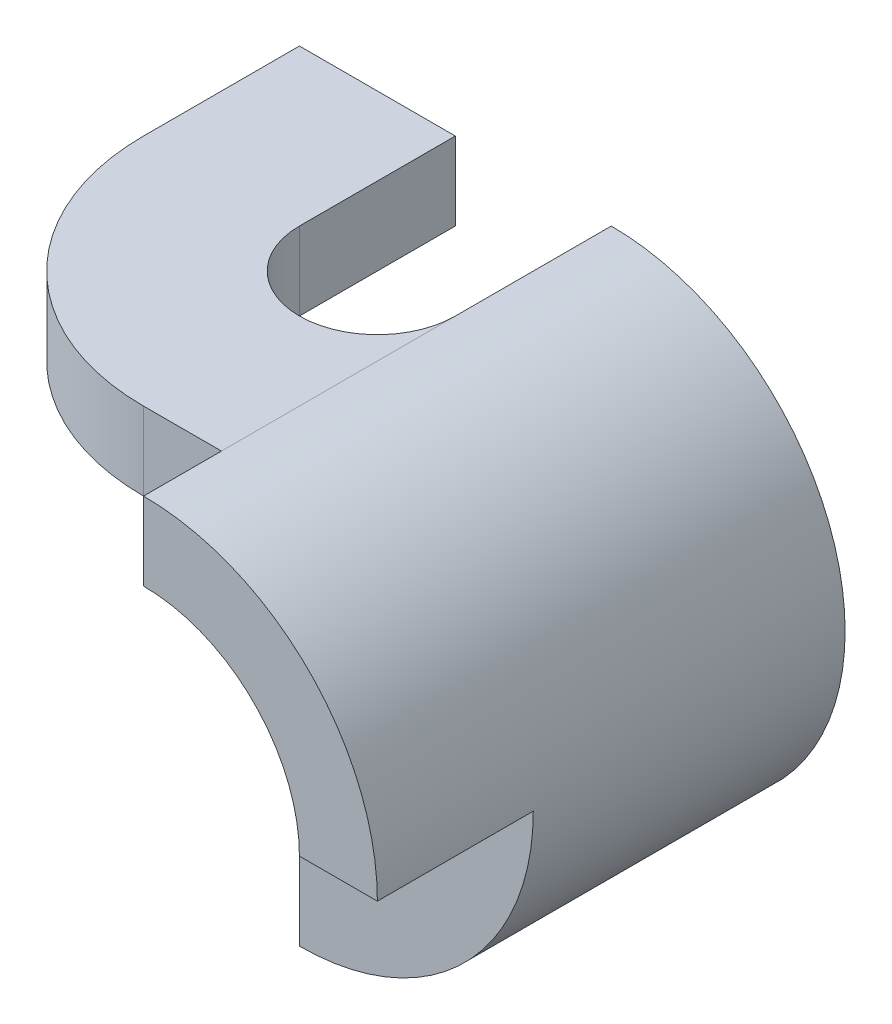
ISO-10303-21;
HEADER;
FILE_DESCRIPTION(('STEP AP214'),'2;1');
FILE_NAME('part.step','',(''),(''),'','','');
FILE_SCHEMA(('AUTOMOTIVE_DESIGN { 1 0 10303 214 1 1 1 1 }'));
ENDSEC;
DATA;
#1=APPLICATION_CONTEXT('core data for automotive mechanical design processes');
#2=APPLICATION_PROTOCOL_DEFINITION('international standard','automotive_design',2000,#1);
#3=PRODUCT_CONTEXT('',#1,'mechanical');
#4=PRODUCT('Part','Part','',(#3));
#5=PRODUCT_RELATED_PRODUCT_CATEGORY('part','',(#4));
#6=PRODUCT_DEFINITION_FORMATION('','',#4);
#7=PRODUCT_DEFINITION_CONTEXT('part definition',#1,'design');
#8=PRODUCT_DEFINITION('design','',#6,#7);
#9=PRODUCT_DEFINITION_SHAPE('','',#8);
#10=(LENGTH_UNIT() NAMED_UNIT(*) SI_UNIT(.MILLI.,.METRE.));
#11=(NAMED_UNIT(*) PLANE_ANGLE_UNIT() SI_UNIT($,.RADIAN.));
#12=(NAMED_UNIT(*) SI_UNIT($,.STERADIAN.) SOLID_ANGLE_UNIT());
#13=UNCERTAINTY_MEASURE_WITH_UNIT(LENGTH_MEASURE(1.E-05),#10,'distance_accuracy_value','');
#14=(GEOMETRIC_REPRESENTATION_CONTEXT(3) GLOBAL_UNCERTAINTY_ASSIGNED_CONTEXT((#13)) GLOBAL_UNIT_ASSIGNED_CONTEXT((#10,
#11,#12)) REPRESENTATION_CONTEXT('',''));
#15=CARTESIAN_POINT('',(0.,0.,0.));
#16=DIRECTION('',(0.,0.,1.));
#17=DIRECTION('',(1.,0.,0.));
#18=AXIS2_PLACEMENT_3D('',#15,#16,#17);
#19=CARTESIAN_POINT('',(0.,0.,0.));
#20=DIRECTION('',(0.,0.,-1.));
#21=DIRECTION('',(-1.,0.,0.));
#22=AXIS2_PLACEMENT_3D('',#19,#20,#21);
#23=PLANE('',#22);
#24=DIRECTION('',(0.,-1.,0.));
#25=VECTOR('',#24,1.);
#26=CARTESIAN_POINT('',(0.,0.,0.));
#27=LINE('',#26,#25);
#28=CARTESIAN_POINT('',(0.,3.,0.));
#29=VERTEX_POINT('',#28);
#30=CARTESIAN_POINT('',(0.,2.,0.));
#31=VERTEX_POINT('',#30);
#32=EDGE_CURVE('E11',#29,#31,#27,.T.);
#33=ORIENTED_EDGE('',*,*,#32,.F.);
#34=CARTESIAN_POINT('',(0.,0.,0.));
#35=DIRECTION('',(0.,0.,1.));
#36=DIRECTION('',(-1.,0.,0.));
#37=AXIS2_PLACEMENT_3D('',#34,#35,#36);
#38=CIRCLE('',#37,3.);
#39=CARTESIAN_POINT('',(0.,-3.,0.));
#40=VERTEX_POINT('',#39);
#41=EDGE_CURVE('E160',#40,#29,#38,.T.);
#42=ORIENTED_EDGE('',*,*,#41,.F.);
#43=DIRECTION('',(1.,0.,0.));
#44=VECTOR('',#43,1.);
#45=CARTESIAN_POINT('',(-0.999999999999999,-3.,0.));
#46=LINE('',#45,#44);
#47=CARTESIAN_POINT('',(-0.999999999999999,-3.,0.));
#48=VERTEX_POINT('',#47);
#49=EDGE_CURVE('E165',#48,#40,#46,.T.);
#50=ORIENTED_EDGE('',*,*,#49,.F.);
#51=DIRECTION('',(0.,-1.,0.));
#52=VECTOR('',#51,1.);
#53=CARTESIAN_POINT('',(-1.,-2.,0.));
#54=LINE('',#53,#52);
#55=CARTESIAN_POINT('',(-1.,-2.,0.));
#56=VERTEX_POINT('',#55);
#57=EDGE_CURVE('E216',#56,#48,#54,.T.);
#58=ORIENTED_EDGE('',*,*,#57,.F.);
#59=DIRECTION('',(-1.,0.,0.));
#60=VECTOR('',#59,1.);
#61=CARTESIAN_POINT('',(0.,-2.,0.));
#62=LINE('',#61,#60);
#63=CARTESIAN_POINT('',(0.,-2.,0.));
#64=VERTEX_POINT('',#63);
#65=EDGE_CURVE('E213',#64,#56,#62,.T.);
#66=ORIENTED_EDGE('',*,*,#65,.F.);
#67=CARTESIAN_POINT('',(0.,0.,0.));
#68=DIRECTION('',(0.,0.,-1.));
#69=DIRECTION('',(-1.,0.,0.));
#70=AXIS2_PLACEMENT_3D('',#67,#68,#69);
#71=CIRCLE('',#70,2.);
#72=EDGE_CURVE('E210',#31,#64,#71,.T.);
#73=ORIENTED_EDGE('',*,*,#72,.F.);
#74=EDGE_LOOP('',(#33,#42,#50,#58,#66,#73));
#75=FACE_BOUND('',#74,.T.);
#76=ADVANCED_FACE('F33',(#75),#23,.T.);
#77=CARTESIAN_POINT('',(-4.,3.,6.));
#78=DIRECTION('',(0.,-1.,0.));
#79=DIRECTION('',(0.,0.,-1.));
#80=AXIS2_PLACEMENT_3D('',#77,#78,#79);
#81=PLANE('',#80);
#82=DIRECTION('',(0.,0.,-1.));
#83=VECTOR('',#82,1.);
#84=CARTESIAN_POINT('',(0.,3.,6.));
#85=LINE('',#84,#83);
#86=CARTESIAN_POINT('',(0.,3.,5.));
#87=VERTEX_POINT('',#86);
#88=CARTESIAN_POINT('',(0.,3.,2.));
#89=VERTEX_POINT('',#88);
#90=EDGE_CURVE('E179',#87,#89,#85,.T.);
#91=ORIENTED_EDGE('',*,*,#90,.T.);
#92=CARTESIAN_POINT('',(-1.,3.,2.));
#93=DIRECTION('',(0.,1.,0.));
#94=DIRECTION('',(0.,0.,1.));
#95=AXIS2_PLACEMENT_3D('',#92,#93,#94);
#96=CIRCLE('',#95,1.);
#97=CARTESIAN_POINT('',(-2.,3.,2.));
#98=VERTEX_POINT('',#97);
#99=EDGE_CURVE('E154',#98,#89,#96,.T.);
#100=ORIENTED_EDGE('',*,*,#99,.F.);
#101=DIRECTION('',(0.,0.,1.));
#102=VECTOR('',#101,1.);
#103=CARTESIAN_POINT('',(-2.,3.,0.));
#104=LINE('',#103,#102);
#105=CARTESIAN_POINT('',(-2.,3.,0.));
#106=VERTEX_POINT('',#105);
#107=EDGE_CURVE('E140',#106,#98,#104,.T.);
#108=ORIENTED_EDGE('',*,*,#107,.F.);
#109=DIRECTION('',(-1.,0.,0.));
#110=VECTOR('',#109,1.);
#111=CARTESIAN_POINT('',(-4.,3.,0.));
#112=LINE('',#111,#110);
#113=CARTESIAN_POINT('',(-4.,3.,0.));
#114=VERTEX_POINT('',#113);
#115=EDGE_CURVE('E151',#106,#114,#112,.T.);
#116=ORIENTED_EDGE('',*,*,#115,.T.);
#117=DIRECTION('',(0.,0.,-1.));
#118=VECTOR('',#117,1.);
#119=CARTESIAN_POINT('',(-4.,3.,6.));
#120=LINE('',#119,#118);
#121=CARTESIAN_POINT('',(-4.,3.,2.));
#122=VERTEX_POINT('',#121);
#123=EDGE_CURVE('E177',#122,#114,#120,.T.);
#124=ORIENTED_EDGE('',*,*,#123,.F.);
#125=CARTESIAN_POINT('',(-0.999999999999995,3.,2.));
#126=DIRECTION('',(0.,-1.,0.));
#127=DIRECTION('',(0.,0.,-1.));
#128=AXIS2_PLACEMENT_3D('',#125,#126,#127);
#129=CIRCLE('',#128,3.00000000000001);
#130=CARTESIAN_POINT('',(-1.,3.,5.));
#131=VERTEX_POINT('',#130);
#132=EDGE_CURVE('E266',#131,#122,#129,.T.);
#133=ORIENTED_EDGE('',*,*,#132,.F.);
#134=DIRECTION('',(-1.,0.,0.));
#135=VECTOR('',#134,1.);
#136=CARTESIAN_POINT('',(-4.,3.,5.));
#137=LINE('',#136,#135);
#138=EDGE_CURVE('E270',#87,#131,#137,.T.);
#139=ORIENTED_EDGE('',*,*,#138,.F.);
#140=EDGE_LOOP('',(#91,#100,#108,#116,#124,#133,#139));
#141=FACE_BOUND('',#140,.T.);
#142=ADVANCED_FACE('F149',(#141),#81,.F.);
#143=CARTESIAN_POINT('',(-4.,2.,6.));
#144=DIRECTION('',(1.,0.,0.));
#145=DIRECTION('',(0.,0.,-1.));
#146=AXIS2_PLACEMENT_3D('',#143,#144,#145);
#147=PLANE('',#146);
#148=DIRECTION('',(0.,-1.,0.));
#149=VECTOR('',#148,1.);
#150=CARTESIAN_POINT('',(-4.,4.,2.));
#151=LINE('',#150,#149);
#152=CARTESIAN_POINT('',(-4.,2.,2.));
#153=VERTEX_POINT('',#152);
#154=EDGE_CURVE('E272',#122,#153,#151,.T.);
#155=ORIENTED_EDGE('',*,*,#154,.F.);
#156=ORIENTED_EDGE('',*,*,#123,.T.);
#157=DIRECTION('',(0.,-1.,0.));
#158=VECTOR('',#157,1.);
#159=CARTESIAN_POINT('',(-4.,2.,0.));
#160=LINE('',#159,#158);
#161=CARTESIAN_POINT('',(-4.,2.,0.));
#162=VERTEX_POINT('',#161);
#163=EDGE_CURVE('E159',#114,#162,#160,.T.);
#164=ORIENTED_EDGE('',*,*,#163,.T.);
#165=DIRECTION('',(0.,0.,-1.));
#166=VECTOR('',#165,1.);
#167=CARTESIAN_POINT('',(-4.,2.,6.));
#168=LINE('',#167,#166);
#169=EDGE_CURVE('E174',#153,#162,#168,.T.);
#170=ORIENTED_EDGE('',*,*,#169,.F.);
#171=EDGE_LOOP('',(#155,#156,#164,#170));
#172=FACE_BOUND('',#171,.T.);
#173=ADVANCED_FACE('F306',(#172),#147,.F.);
#174=CARTESIAN_POINT('',(0.,2.,6.));
#175=DIRECTION('',(0.,1.,0.));
#176=DIRECTION('',(-1.,0.,0.));
#177=AXIS2_PLACEMENT_3D('',#174,#175,#176);
#178=PLANE('',#177);
#179=DIRECTION('',(0.,0.,1.));
#180=VECTOR('',#179,1.);
#181=CARTESIAN_POINT('',(-2.,2.,6.));
#182=LINE('',#181,#180);
#183=CARTESIAN_POINT('',(-2.,2.,0.));
#184=VERTEX_POINT('',#183);
#185=CARTESIAN_POINT('',(-2.,2.,2.));
#186=VERTEX_POINT('',#185);
#187=EDGE_CURVE('E48',#184,#186,#182,.T.);
#188=ORIENTED_EDGE('',*,*,#187,.T.);
#189=CARTESIAN_POINT('',(-1.,2.,2.));
#190=DIRECTION('',(0.,1.,0.));
#191=DIRECTION('',(-1.,0.,0.));
#192=AXIS2_PLACEMENT_3D('',#189,#190,#191);
#193=CIRCLE('',#192,1.);
#194=CARTESIAN_POINT('',(0.,2.,2.));
#195=VERTEX_POINT('',#194);
#196=EDGE_CURVE('E284',#186,#195,#193,.T.);
#197=ORIENTED_EDGE('',*,*,#196,.T.);
#198=DIRECTION('',(0.,0.,-1.));
#199=VECTOR('',#198,1.);
#200=CARTESIAN_POINT('',(0.,2.,6.));
#201=LINE('',#200,#199);
#202=CARTESIAN_POINT('',(0.,2.,5.));
#203=VERTEX_POINT('',#202);
#204=EDGE_CURVE('E175',#203,#195,#201,.T.);
#205=ORIENTED_EDGE('',*,*,#204,.F.);
#206=DIRECTION('',(-1.,0.,0.));
#207=VECTOR('',#206,1.);
#208=CARTESIAN_POINT('',(0.,2.,5.));
#209=LINE('',#208,#207);
#210=CARTESIAN_POINT('',(-1.,2.,5.));
#211=VERTEX_POINT('',#210);
#212=EDGE_CURVE('E276',#203,#211,#209,.T.);
#213=ORIENTED_EDGE('',*,*,#212,.T.);
#214=CARTESIAN_POINT('',(-0.999999999999995,2.,2.));
#215=DIRECTION('',(0.,-1.,0.));
#216=DIRECTION('',(1.,0.,0.));
#217=AXIS2_PLACEMENT_3D('',#214,#215,#216);
#218=CIRCLE('',#217,3.00000000000001);
#219=EDGE_CURVE('E281',#211,#153,#218,.T.);
#220=ORIENTED_EDGE('',*,*,#219,.T.);
#221=ORIENTED_EDGE('',*,*,#169,.T.);
#222=DIRECTION('',(1.,0.,0.));
#223=VECTOR('',#222,1.);
#224=CARTESIAN_POINT('',(0.,2.,0.));
#225=LINE('',#224,#223);
#226=EDGE_CURVE('E162',#162,#184,#225,.T.);
#227=ORIENTED_EDGE('',*,*,#226,.T.);
#228=EDGE_LOOP('',(#188,#197,#205,#213,#220,#221,#227));
#229=FACE_BOUND('',#228,.T.);
#230=ADVANCED_FACE('F300',(#229),#178,.F.);
#231=CARTESIAN_POINT('',(0.,0.,6.));
#232=DIRECTION('',(0.,0.,-1.));
#233=DIRECTION('',(-1.,0.,0.));
#234=AXIS2_PLACEMENT_3D('',#231,#232,#233);
#235=CYLINDRICAL_SURFACE('',#234,2.);
#236=CARTESIAN_POINT('',(0.,0.,4.));
#237=DIRECTION('',(0.,0.,-1.));
#238=DIRECTION('',(-1.,0.,0.));
#239=AXIS2_PLACEMENT_3D('',#236,#237,#238);
#240=CIRCLE('',#239,2.);
#241=CARTESIAN_POINT('',(2.,0.,4.));
#242=VERTEX_POINT('',#241);
#243=CARTESIAN_POINT('',(0.,-2.,4.));
#244=VERTEX_POINT('',#243);
#245=EDGE_CURVE('E244',#242,#244,#240,.T.);
#246=ORIENTED_EDGE('',*,*,#245,.F.);
#247=DIRECTION('',(0.,0.,1.));
#248=VECTOR('',#247,1.);
#249=CARTESIAN_POINT('',(2.,0.,4.));
#250=LINE('',#249,#248);
#251=CARTESIAN_POINT('',(2.,0.,6.));
#252=VERTEX_POINT('',#251);
#253=EDGE_CURVE('E204',#242,#252,#250,.T.);
#254=ORIENTED_EDGE('',*,*,#253,.T.);
#255=CARTESIAN_POINT('',(0.,0.,6.));
#256=DIRECTION('',(0.,0.,-1.));
#257=DIRECTION('',(-1.,0.,0.));
#258=AXIS2_PLACEMENT_3D('',#255,#256,#257);
#259=CIRCLE('',#258,2.);
#260=CARTESIAN_POINT('',(0.,2.,6.));
#261=VERTEX_POINT('',#260);
#262=EDGE_CURVE('E170',#261,#252,#259,.T.);
#263=ORIENTED_EDGE('',*,*,#262,.F.);
#264=EDGE_CURVE('E171',#261,#203,#201,.T.);
#265=ORIENTED_EDGE('',*,*,#264,.T.);
#266=ORIENTED_EDGE('',*,*,#204,.T.);
#267=DIRECTION('',(0.,0.,-1.));
#268=VECTOR('',#267,1.);
#269=CARTESIAN_POINT('',(0.,2.,6.));
#270=LINE('',#269,#268);
#271=EDGE_CURVE('E287',#195,#31,#270,.T.);
#272=ORIENTED_EDGE('',*,*,#271,.T.);
#273=ORIENTED_EDGE('',*,*,#72,.T.);
#274=DIRECTION('',(0.,0.,-1.));
#275=VECTOR('',#274,1.);
#276=CARTESIAN_POINT('',(0.,-2.,6.));
#277=LINE('',#276,#275);
#278=EDGE_CURVE('E188',#244,#64,#277,.T.);
#279=ORIENTED_EDGE('',*,*,#278,.F.);
#280=EDGE_LOOP('',(#246,#254,#263,#265,#266,#272,#273,#279));
#281=FACE_BOUND('',#280,.T.);
#282=ADVANCED_FACE('F35',(#281),#235,.F.);
#283=CARTESIAN_POINT('',(0.,-2.,6.));
#284=DIRECTION('',(0.,-1.,0.));
#285=DIRECTION('',(1.,0.,0.));
#286=AXIS2_PLACEMENT_3D('',#283,#284,#285);
#287=PLANE('',#286);
#288=DIRECTION('',(0.,0.,-1.));
#289=VECTOR('',#288,1.);
#290=CARTESIAN_POINT('',(-1.,-2.,6.));
#291=LINE('',#290,#289);
#292=CARTESIAN_POINT('',(-0.999999999999999,-2.,2.));
#293=VERTEX_POINT('',#292);
#294=EDGE_CURVE('E186',#293,#56,#291,.T.);
#295=ORIENTED_EDGE('',*,*,#294,.F.);
#296=DIRECTION('',(0.447213595499958,0.,0.894427190999916));
#297=VECTOR('',#296,1.);
#298=CARTESIAN_POINT('',(0.8,-2.,5.6));
#299=LINE('',#298,#297);
#300=EDGE_CURVE('E246',#293,#244,#299,.T.);
#301=ORIENTED_EDGE('',*,*,#300,.T.);
#302=ORIENTED_EDGE('',*,*,#278,.T.);
#303=ORIENTED_EDGE('',*,*,#65,.T.);
#304=EDGE_LOOP('',(#295,#301,#302,#303));
#305=FACE_BOUND('',#304,.T.);
#306=ADVANCED_FACE('F263',(#305),#287,.F.);
#307=CARTESIAN_POINT('',(-1.,-2.,6.));
#308=DIRECTION('',(1.,0.,0.));
#309=DIRECTION('',(0.,1.,0.));
#310=AXIS2_PLACEMENT_3D('',#307,#308,#309);
#311=PLANE('',#310);
#312=DIRECTION('',(0.,0.,-1.));
#313=VECTOR('',#312,1.);
#314=CARTESIAN_POINT('',(-0.999999999999999,-3.,6.));
#315=LINE('',#314,#313);
#316=CARTESIAN_POINT('',(-0.999999999999999,-3.,2.));
#317=VERTEX_POINT('',#316);
#318=EDGE_CURVE('E184',#317,#48,#315,.T.);
#319=ORIENTED_EDGE('',*,*,#318,.F.);
#320=DIRECTION('',(0.,-1.,0.));
#321=VECTOR('',#320,1.);
#322=CARTESIAN_POINT('',(-0.999999999999999,-1.,2.));
#323=LINE('',#322,#321);
#324=EDGE_CURVE('E265',#293,#317,#323,.T.);
#325=ORIENTED_EDGE('',*,*,#324,.F.);
#326=ORIENTED_EDGE('',*,*,#294,.T.);
#327=ORIENTED_EDGE('',*,*,#57,.T.);
#328=EDGE_LOOP('',(#319,#325,#326,#327));
#329=FACE_BOUND('',#328,.T.);
#330=ADVANCED_FACE('F435',(#329),#311,.F.);
#331=CARTESIAN_POINT('',(-0.999999999999999,-3.,6.));
#332=DIRECTION('',(0.,1.,0.));
#333=DIRECTION('',(0.,0.,1.));
#334=AXIS2_PLACEMENT_3D('',#331,#332,#333);
#335=PLANE('',#334);
#336=DIRECTION('',(0.,0.,-1.));
#337=VECTOR('',#336,1.);
#338=CARTESIAN_POINT('',(0.,-3.,6.));
#339=LINE('',#338,#337);
#340=CARTESIAN_POINT('',(0.,-3.,4.));
#341=VERTEX_POINT('',#340);
#342=EDGE_CURVE('E182',#341,#40,#339,.T.);
#343=ORIENTED_EDGE('',*,*,#342,.F.);
#344=DIRECTION('',(0.447213595499958,0.,0.894427190999916));
#345=VECTOR('',#344,1.);
#346=CARTESIAN_POINT('',(0.,-3.,4.));
#347=LINE('',#346,#345);
#348=EDGE_CURVE('E260',#317,#341,#347,.T.);
#349=ORIENTED_EDGE('',*,*,#348,.F.);
#350=ORIENTED_EDGE('',*,*,#318,.T.);
#351=ORIENTED_EDGE('',*,*,#49,.T.);
#352=EDGE_LOOP('',(#343,#349,#350,#351));
#353=FACE_BOUND('',#352,.T.);
#354=ADVANCED_FACE('F223',(#353),#335,.F.);
#355=CARTESIAN_POINT('',(0.,0.,6.));
#356=DIRECTION('',(0.,0.,-1.));
#357=DIRECTION('',(-1.,0.,0.));
#358=AXIS2_PLACEMENT_3D('',#355,#356,#357);
#359=CYLINDRICAL_SURFACE('',#358,3.);
#360=CARTESIAN_POINT('',(0.,0.,6.));
#361=DIRECTION('',(0.,0.,1.));
#362=DIRECTION('',(-1.,0.,0.));
#363=AXIS2_PLACEMENT_3D('',#360,#361,#362);
#364=CIRCLE('',#363,3.);
#365=CARTESIAN_POINT('',(3.,0.,6.));
#366=VERTEX_POINT('',#365);
#367=CARTESIAN_POINT('',(0.,3.,6.));
#368=VERTEX_POINT('',#367);
#369=EDGE_CURVE('E197',#366,#368,#364,.T.);
#370=ORIENTED_EDGE('',*,*,#369,.F.);
#371=DIRECTION('',(0.,0.,1.));
#372=VECTOR('',#371,1.);
#373=CARTESIAN_POINT('',(3.,0.,4.));
#374=LINE('',#373,#372);
#375=CARTESIAN_POINT('',(3.,0.,4.));
#376=VERTEX_POINT('',#375);
#377=EDGE_CURVE('E56',#376,#366,#374,.T.);
#378=ORIENTED_EDGE('',*,*,#377,.F.);
#379=CARTESIAN_POINT('',(0.,0.,4.));
#380=DIRECTION('',(0.,0.,1.));
#381=DIRECTION('',(-1.,0.,0.));
#382=AXIS2_PLACEMENT_3D('',#379,#380,#381);
#383=CIRCLE('',#382,3.);
#384=EDGE_CURVE('E237',#341,#376,#383,.T.);
#385=ORIENTED_EDGE('',*,*,#384,.F.);
#386=ORIENTED_EDGE('',*,*,#342,.T.);
#387=ORIENTED_EDGE('',*,*,#41,.T.);
#388=DIRECTION('',(0.,0.,-1.));
#389=VECTOR('',#388,1.);
#390=CARTESIAN_POINT('',(0.,3.,0.));
#391=LINE('',#390,#389);
#392=EDGE_CURVE('E234',#89,#29,#391,.T.);
#393=ORIENTED_EDGE('',*,*,#392,.F.);
#394=ORIENTED_EDGE('',*,*,#90,.F.);
#395=EDGE_CURVE('E180',#368,#87,#85,.T.);
#396=ORIENTED_EDGE('',*,*,#395,.F.);
#397=EDGE_LOOP('',(#370,#378,#385,#386,#387,#393,#394,#396));
#398=FACE_BOUND('',#397,.T.);
#399=ADVANCED_FACE('F232',(#398),#359,.T.);
#400=CARTESIAN_POINT('',(0.,0.,6.));
#401=DIRECTION('',(0.,0.,-1.));
#402=DIRECTION('',(-1.,0.,0.));
#403=AXIS2_PLACEMENT_3D('',#400,#401,#402);
#404=PLANE('',#403);
#405=ORIENTED_EDGE('',*,*,#369,.T.);
#406=DIRECTION('',(0.,-1.,0.));
#407=VECTOR('',#406,1.);
#408=CARTESIAN_POINT('',(0.,0.,6.));
#409=LINE('',#408,#407);
#410=EDGE_CURVE('E146',#368,#261,#409,.T.);
#411=ORIENTED_EDGE('',*,*,#410,.T.);
#412=ORIENTED_EDGE('',*,*,#262,.T.);
#413=DIRECTION('',(-1.,0.,0.));
#414=VECTOR('',#413,1.);
#415=CARTESIAN_POINT('',(3.,0.,6.));
#416=LINE('',#415,#414);
#417=EDGE_CURVE('E242',#366,#252,#416,.T.);
#418=ORIENTED_EDGE('',*,*,#417,.F.);
#419=EDGE_LOOP('',(#405,#411,#412,#418));
#420=FACE_BOUND('',#419,.T.);
#421=ADVANCED_FACE('F195',(#420),#404,.F.);
#422=DIRECTION('',(0.,1.,0.));
#423=VECTOR('',#422,1.);
#424=CARTESIAN_POINT('',(-2.,0.,0.));
#425=LINE('',#424,#423);
#426=EDGE_CURVE('E41',#184,#106,#425,.T.);
#427=ORIENTED_EDGE('',*,*,#426,.F.);
#428=ORIENTED_EDGE('',*,*,#226,.F.);
#429=ORIENTED_EDGE('',*,*,#163,.F.);
#430=ORIENTED_EDGE('',*,*,#115,.F.);
#431=EDGE_LOOP('',(#427,#428,#429,#430));
#432=FACE_BOUND('',#431,.T.);
#433=ADVANCED_FACE('F157',(#432),#23,.T.);
#434=CARTESIAN_POINT('',(3.,0.,4.));
#435=DIRECTION('',(0.,1.,0.));
#436=DIRECTION('',(0.,0.,1.));
#437=AXIS2_PLACEMENT_3D('',#434,#435,#436);
#438=PLANE('',#437);
#439=ORIENTED_EDGE('',*,*,#417,.T.);
#440=ORIENTED_EDGE('',*,*,#253,.F.);
#441=DIRECTION('',(-1.,0.,0.));
#442=VECTOR('',#441,1.);
#443=CARTESIAN_POINT('',(3.,0.,4.));
#444=LINE('',#443,#442);
#445=EDGE_CURVE('E241',#376,#242,#444,.T.);
#446=ORIENTED_EDGE('',*,*,#445,.F.);
#447=ORIENTED_EDGE('',*,*,#377,.T.);
#448=EDGE_LOOP('',(#439,#440,#446,#447));
#449=FACE_BOUND('',#448,.T.);
#450=ADVANCED_FACE('F336',(#449),#438,.F.);
#451=CARTESIAN_POINT('',(0.,0.,4.));
#452=DIRECTION('',(0.,0.,-1.));
#453=DIRECTION('',(-1.,0.,0.));
#454=AXIS2_PLACEMENT_3D('',#451,#452,#453);
#455=PLANE('',#454);
#456=ORIENTED_EDGE('',*,*,#384,.T.);
#457=ORIENTED_EDGE('',*,*,#445,.T.);
#458=ORIENTED_EDGE('',*,*,#245,.T.);
#459=DIRECTION('',(0.,-1.,0.));
#460=VECTOR('',#459,1.);
#461=CARTESIAN_POINT('',(0.,-2.,4.));
#462=LINE('',#461,#460);
#463=EDGE_CURVE('E253',#244,#341,#462,.T.);
#464=ORIENTED_EDGE('',*,*,#463,.T.);
#465=EDGE_LOOP('',(#456,#457,#458,#464));
#466=FACE_BOUND('',#465,.T.);
#467=ADVANCED_FACE('F254',(#466),#455,.F.);
#468=CARTESIAN_POINT('',(0.,-1.,4.));
#469=DIRECTION('',(0.894427190999916,0.,-0.447213595499958));
#470=DIRECTION('',(-0.447213595499958,0.,-0.894427190999916));
#471=AXIS2_PLACEMENT_3D('',#468,#469,#470);
#472=PLANE('',#471);
#473=ORIENTED_EDGE('',*,*,#324,.T.);
#474=ORIENTED_EDGE('',*,*,#348,.T.);
#475=ORIENTED_EDGE('',*,*,#463,.F.);
#476=ORIENTED_EDGE('',*,*,#300,.F.);
#477=EDGE_LOOP('',(#473,#474,#475,#476));
#478=FACE_BOUND('',#477,.T.);
#479=ADVANCED_FACE('F258',(#478),#472,.F.);
#480=CARTESIAN_POINT('',(-0.999999999999995,4.,2.));
#481=DIRECTION('',(0.,-1.,0.));
#482=DIRECTION('',(1.,0.,0.));
#483=AXIS2_PLACEMENT_3D('',#480,#481,#482);
#484=CYLINDRICAL_SURFACE('',#483,3.00000000000001);
#485=ORIENTED_EDGE('',*,*,#132,.T.);
#486=ORIENTED_EDGE('',*,*,#154,.T.);
#487=ORIENTED_EDGE('',*,*,#219,.F.);
#488=DIRECTION('',(0.,-1.,0.));
#489=VECTOR('',#488,1.);
#490=CARTESIAN_POINT('',(-1.,4.,5.));
#491=LINE('',#490,#489);
#492=EDGE_CURVE('E273',#131,#211,#491,.T.);
#493=ORIENTED_EDGE('',*,*,#492,.F.);
#494=EDGE_LOOP('',(#485,#486,#487,#493));
#495=FACE_BOUND('',#494,.T.);
#496=ADVANCED_FACE('F311',(#495),#484,.T.);
#497=CARTESIAN_POINT('',(0.,4.,5.));
#498=DIRECTION('',(0.,0.,1.));
#499=DIRECTION('',(1.,0.,0.));
#500=AXIS2_PLACEMENT_3D('',#497,#498,#499);
#501=PLANE('',#500);
#502=ORIENTED_EDGE('',*,*,#138,.T.);
#503=ORIENTED_EDGE('',*,*,#492,.T.);
#504=ORIENTED_EDGE('',*,*,#212,.F.);
#505=DIRECTION('',(0.,-1.,0.));
#506=VECTOR('',#505,1.);
#507=CARTESIAN_POINT('',(0.,4.,5.));
#508=LINE('',#507,#506);
#509=EDGE_CURVE('E275',#87,#203,#508,.T.);
#510=ORIENTED_EDGE('',*,*,#509,.F.);
#511=EDGE_LOOP('',(#502,#503,#504,#510));
#512=FACE_BOUND('',#511,.T.);
#513=ADVANCED_FACE('F314',(#512),#501,.T.);
#514=CARTESIAN_POINT('',(0.,4.,0.));
#515=DIRECTION('',(1.,0.,0.));
#516=DIRECTION('',(0.,1.,0.));
#517=AXIS2_PLACEMENT_3D('',#514,#515,#516);
#518=PLANE('',#517);
#519=ORIENTED_EDGE('',*,*,#509,.T.);
#520=ORIENTED_EDGE('',*,*,#264,.F.);
#521=ORIENTED_EDGE('',*,*,#410,.F.);
#522=ORIENTED_EDGE('',*,*,#395,.T.);
#523=EDGE_LOOP('',(#519,#520,#521,#522));
#524=FACE_BOUND('',#523,.T.);
#525=ADVANCED_FACE('F316',(#524),#518,.F.);
#526=CARTESIAN_POINT('',(-1.,0.,2.));
#527=DIRECTION('',(0.,1.,0.));
#528=DIRECTION('',(0.,0.,1.));
#529=AXIS2_PLACEMENT_3D('',#526,#527,#528);
#530=CYLINDRICAL_SURFACE('',#529,1.);
#531=DIRECTION('',(0.,1.,0.));
#532=VECTOR('',#531,1.);
#533=CARTESIAN_POINT('',(-2.,0.,2.));
#534=LINE('',#533,#532);
#535=EDGE_CURVE('E292',#186,#98,#534,.T.);
#536=ORIENTED_EDGE('',*,*,#535,.T.);
#537=ORIENTED_EDGE('',*,*,#99,.T.);
#538=DIRECTION('',(0.,1.,0.));
#539=VECTOR('',#538,1.);
#540=CARTESIAN_POINT('',(0.,0.,2.));
#541=LINE('',#540,#539);
#542=EDGE_CURVE('E291',#195,#89,#541,.T.);
#543=ORIENTED_EDGE('',*,*,#542,.F.);
#544=ORIENTED_EDGE('',*,*,#196,.F.);
#545=EDGE_LOOP('',(#536,#537,#543,#544));
#546=FACE_BOUND('',#545,.T.);
#547=ADVANCED_FACE('F298',(#546),#530,.F.);
#548=CARTESIAN_POINT('',(0.,0.,0.));
#549=DIRECTION('',(1.,0.,0.));
#550=DIRECTION('',(0.,0.,-1.));
#551=AXIS2_PLACEMENT_3D('',#548,#549,#550);
#552=PLANE('',#551);
#553=ORIENTED_EDGE('',*,*,#542,.T.);
#554=ORIENTED_EDGE('',*,*,#392,.T.);
#555=ORIENTED_EDGE('',*,*,#32,.T.);
#556=ORIENTED_EDGE('',*,*,#271,.F.);
#557=EDGE_LOOP('',(#553,#554,#555,#556));
#558=FACE_BOUND('',#557,.T.);
#559=ADVANCED_FACE('F323',(#558),#552,.F.);
#560=CARTESIAN_POINT('',(-2.,0.,0.));
#561=DIRECTION('',(-1.,0.,0.));
#562=DIRECTION('',(0.,0.,1.));
#563=AXIS2_PLACEMENT_3D('',#560,#561,#562);
#564=PLANE('',#563);
#565=ORIENTED_EDGE('',*,*,#426,.T.);
#566=ORIENTED_EDGE('',*,*,#107,.T.);
#567=ORIENTED_EDGE('',*,*,#535,.F.);
#568=ORIENTED_EDGE('',*,*,#187,.F.);
#569=EDGE_LOOP('',(#565,#566,#567,#568));
#570=FACE_BOUND('',#569,.T.);
#571=ADVANCED_FACE('F139',(#570),#564,.F.);
#572=CLOSED_SHELL('',(#76,#142,#173,#230,#282,#306,#330,#354,#399,#421,#433,#450,#467,#479,#496,
#513,#525,#547,#559,#571));
#573=MANIFOLD_SOLID_BREP('B2',#572);
#574=ADVANCED_BREP_SHAPE_REPRESENTATION('',(#18,#573),#14);
#575=SHAPE_DEFINITION_REPRESENTATION(#9,#574);
ENDSEC;
END-ISO-10303-21;
